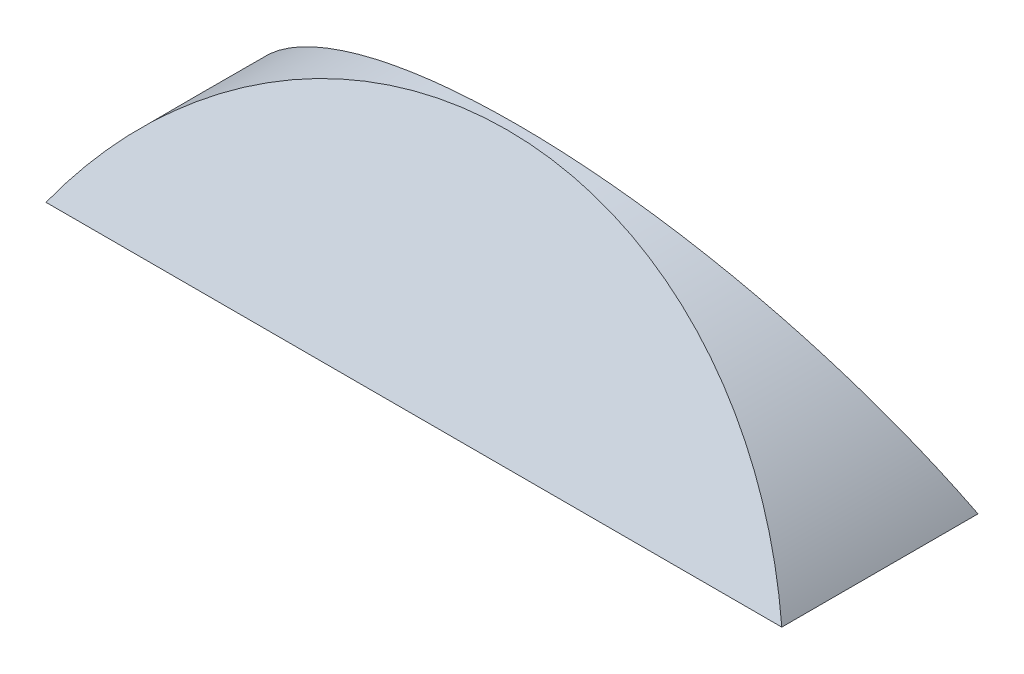
ISO-10303-21;
HEADER;
FILE_DESCRIPTION(('STEP AP214'),'2;1');
FILE_NAME('part.step','',(''),(''),'','','');
FILE_SCHEMA(('AUTOMOTIVE_DESIGN { 1 0 10303 214 1 1 1 1 }'));
ENDSEC;
DATA;
#1=APPLICATION_CONTEXT('core data for automotive mechanical design processes');
#2=APPLICATION_PROTOCOL_DEFINITION('international standard','automotive_design',2000,#1);
#3=PRODUCT_CONTEXT('',#1,'mechanical');
#4=PRODUCT('Part','Part','',(#3));
#5=PRODUCT_RELATED_PRODUCT_CATEGORY('part','',(#4));
#6=PRODUCT_DEFINITION_FORMATION('','',#4);
#7=PRODUCT_DEFINITION_CONTEXT('part definition',#1,'design');
#8=PRODUCT_DEFINITION('design','',#6,#7);
#9=PRODUCT_DEFINITION_SHAPE('','',#8);
#10=(LENGTH_UNIT() NAMED_UNIT(*) SI_UNIT(.MILLI.,.METRE.));
#11=(NAMED_UNIT(*) PLANE_ANGLE_UNIT() SI_UNIT($,.RADIAN.));
#12=(NAMED_UNIT(*) SI_UNIT($,.STERADIAN.) SOLID_ANGLE_UNIT());
#13=UNCERTAINTY_MEASURE_WITH_UNIT(LENGTH_MEASURE(1.E-05),#10,'distance_accuracy_value','');
#14=(GEOMETRIC_REPRESENTATION_CONTEXT(3) GLOBAL_UNCERTAINTY_ASSIGNED_CONTEXT((#13)) GLOBAL_UNIT_ASSIGNED_CONTEXT((#10,
#11,#12)) REPRESENTATION_CONTEXT('',''));
#15=CARTESIAN_POINT('',(0.,0.,0.));
#16=DIRECTION('',(0.,0.,1.));
#17=DIRECTION('',(1.,0.,0.));
#18=AXIS2_PLACEMENT_3D('',#15,#16,#17);
#19=CARTESIAN_POINT('',(0.,-36.252311481466,-36.904730469628));
#20=DIRECTION('',(0.,-0.4226182617407,0.90630778703665));
#21=DIRECTION('',(0.,-0.90630778703665,-0.4226182617407));
#22=AXIS2_PLACEMENT_3D('',#19,#20,#21);
#23=PLANE('',#22);
#24=CARTESIAN_POINT('',(0.,-36.252311481466,-36.904730469628));
#25=DIRECTION('',(0.,-0.4226182617407,0.90630778703665));
#26=DIRECTION('',(0.,-0.90630778703665,-0.4226182617407));
#27=AXIS2_PLACEMENT_3D('',#24,#25,#26);
#28=CIRCLE('',#27,85.);
#29=CARTESIAN_POINT('',(75.,0.,-20.));
#30=VERTEX_POINT('',#29);
#31=CARTESIAN_POINT('',(-75.,0.,-20.));
#32=VERTEX_POINT('',#31);
#33=EDGE_CURVE('E86',#30,#32,#28,.T.);
#34=ORIENTED_EDGE('',*,*,#33,.F.);
#35=DIRECTION('',(1.,0.,0.));
#36=VECTOR('',#35,1.);
#37=CARTESIAN_POINT('',(-75.,0.,-20.));
#38=LINE('',#37,#36);
#39=EDGE_CURVE('E78',#32,#30,#38,.T.);
#40=ORIENTED_EDGE('',*,*,#39,.F.);
#41=EDGE_LOOP('',(#34,#40));
#42=FACE_BOUND('',#41,.T.);
#43=ADVANCED_FACE('F51',(#42),#23,.F.);
#44=CARTESIAN_POINT('',(0.,-36.252311481466,36.904730469628));
#45=DIRECTION('',(0.,-0.4226182617407,-0.90630778703665));
#46=DIRECTION('',(0.,0.90630778703665,-0.4226182617407));
#47=AXIS2_PLACEMENT_3D('',#44,#45,#46);
#48=PLANE('',#47);
#49=CARTESIAN_POINT('',(0.,-36.252311481466,36.904730469628));
#50=DIRECTION('',(0.,0.4226182617407,0.90630778703665));
#51=DIRECTION('',(0.,0.90630778703665,-0.4226182617407));
#52=AXIS2_PLACEMENT_3D('',#49,#50,#51);
#53=CIRCLE('',#52,85.);
#54=CARTESIAN_POINT('',(75.,0.,20.));
#55=VERTEX_POINT('',#54);
#56=CARTESIAN_POINT('',(-75.,0.,20.));
#57=VERTEX_POINT('',#56);
#58=EDGE_CURVE('E62',#55,#57,#53,.T.);
#59=ORIENTED_EDGE('',*,*,#58,.T.);
#60=DIRECTION('',(1.,0.,0.));
#61=VECTOR('',#60,1.);
#62=CARTESIAN_POINT('',(-75.,0.,20.));
#63=LINE('',#62,#61);
#64=EDGE_CURVE('E12',#57,#55,#63,.T.);
#65=ORIENTED_EDGE('',*,*,#64,.T.);
#66=EDGE_LOOP('',(#59,#65));
#67=FACE_BOUND('',#66,.T.);
#68=ADVANCED_FACE('F111',(#67),#48,.F.);
#69=CARTESIAN_POINT('',(0.,0.,0.));
#70=DIRECTION('',(0.,-1.,0.));
#71=DIRECTION('',(0.,0.,-1.));
#72=AXIS2_PLACEMENT_3D('',#69,#70,#71);
#73=PLANE('',#72);
#74=DIRECTION('',(0.,0.,-1.));
#75=VECTOR('',#74,1.);
#76=CARTESIAN_POINT('',(-75.,0.,20.));
#77=LINE('',#76,#75);
#78=EDGE_CURVE('E91',#57,#32,#77,.T.);
#79=ORIENTED_EDGE('',*,*,#78,.T.);
#80=ORIENTED_EDGE('',*,*,#39,.T.);
#81=DIRECTION('',(0.,0.,-1.));
#82=VECTOR('',#81,1.);
#83=CARTESIAN_POINT('',(75.,0.,20.));
#84=LINE('',#83,#82);
#85=EDGE_CURVE('E84',#55,#30,#84,.T.);
#86=ORIENTED_EDGE('',*,*,#85,.F.);
#87=ORIENTED_EDGE('',*,*,#64,.F.);
#88=EDGE_LOOP('',(#79,#80,#86,#87));
#89=FACE_BOUND('',#88,.T.);
#90=ADVANCED_FACE('F94',(#89),#73,.T.);
#91=CARTESIAN_POINT('',(-75.,0.,20.));
#92=CARTESIAN_POINT('',(-75.,0.,-20.));
#93=CARTESIAN_POINT('',(-73.5294117647059,2.49901044219666,18.8346922929944));
#94=CARTESIAN_POINT('',(-73.5294117647059,2.49901044219666,-18.8346922929944));
#95=CARTESIAN_POINT('',(-71.8576386429974,5.00789171171203,17.6647817436177));
#96=CARTESIAN_POINT('',(-71.8576386429974,5.00789171171203,-17.6647817436177));
#97=CARTESIAN_POINT('',(-68.073767530447,9.97882451194646,15.3467977106945));
#98=CARTESIAN_POINT('',(-68.073767530447,9.97882451194646,-15.3467977106945));
#99=CARTESIAN_POINT('',(-65.9614195996733,12.4408186477195,14.1987509908509));
#100=CARTESIAN_POINT('',(-65.9614195996733,12.4408186477195,-14.1987509908509));
#101=CARTESIAN_POINT('',(-61.273507635254,17.2355797843538,11.9629171538143));
#102=CARTESIAN_POINT('',(-61.273507635254,17.2355797843538,-11.9629171538143));
#103=CARTESIAN_POINT('',(-58.6976918746482,19.5681868396791,10.8752046204498));
#104=CARTESIAN_POINT('',(-58.6976918746482,19.5681868396791,-10.8752046204498));
#105=CARTESIAN_POINT('',(-53.0831300431601,24.0090779890694,8.8043830684563));
#106=CARTESIAN_POINT('',(-53.08313004316,24.0090779890694,-8.80438306845629));
#107=CARTESIAN_POINT('',(-50.0441881996465,26.1170885099464,7.82140161910006));
#108=CARTESIAN_POINT('',(-50.0441881996465,26.1170885099464,-7.82140161910006));
#109=CARTESIAN_POINT('',(-43.5337934517297,30.0074762836076,6.00728400704924));
#110=CARTESIAN_POINT('',(-43.5337934517297,30.0074762836076,-6.00728400704925));
#111=CARTESIAN_POINT('',(-40.0622699513512,31.7894858522894,5.17631929826743));
#112=CARTESIAN_POINT('',(-40.0622699513511,31.7894858522894,-5.17631929826743));
#113=CARTESIAN_POINT('',(-32.7515313573936,34.9300790767917,3.7118366265323));
#114=CARTESIAN_POINT('',(-32.7515313573936,34.9300790767917,-3.7118366265323));
#115=CARTESIAN_POINT('',(-28.9124287874893,36.288259091577,3.07850688448484));
#116=CARTESIAN_POINT('',(-28.9124287874893,36.288259091577,-3.07850688448484));
#117=CARTESIAN_POINT('',(-20.9653218237576,38.4987526748946,2.04773679828135));
#118=CARTESIAN_POINT('',(-20.9653218237576,38.4987526748947,-2.04773679828135));
#119=CARTESIAN_POINT('',(-16.8576307678877,39.3507155489836,1.65045998562992));
#120=CARTESIAN_POINT('',(-16.8576307678877,39.3507155489836,-1.65045998562993));
#121=CARTESIAN_POINT('',(-8.4997340549836,40.4933669944875,1.11763286598956));
#122=CARTESIAN_POINT('',(-8.49973405498361,40.4933669944875,-1.11763286598957));
#123=CARTESIAN_POINT('',(-4.25,40.7838504166492,0.982178221668493));
#124=CARTESIAN_POINT('',(-4.25,40.7838504166492,-0.982178221668498));
#125=CARTESIAN_POINT('',(4.25,40.7838504166492,0.982178221668494));
#126=CARTESIAN_POINT('',(4.25,40.7838504166492,-0.9821782216685));
#127=CARTESIAN_POINT('',(8.49973405498358,40.4933669944875,1.11763286598957));
#128=CARTESIAN_POINT('',(8.49973405498359,40.4933669944875,-1.11763286598957));
#129=CARTESIAN_POINT('',(16.8576307678877,39.3507155489836,1.65045998562992));
#130=CARTESIAN_POINT('',(16.8576307678877,39.3507155489836,-1.65045998562993));
#131=CARTESIAN_POINT('',(20.9653218237576,38.4987526748947,2.04773679828135));
#132=CARTESIAN_POINT('',(20.9653218237576,38.4987526748946,-2.04773679828136));
#133=CARTESIAN_POINT('',(28.9124287874893,36.288259091577,3.07850688448484));
#134=CARTESIAN_POINT('',(28.9124287874893,36.288259091577,-3.07850688448484));
#135=CARTESIAN_POINT('',(32.7515313573936,34.9300790767917,3.7118366265323));
#136=CARTESIAN_POINT('',(32.7515313573936,34.9300790767917,-3.71183662653231));
#137=CARTESIAN_POINT('',(40.0622699513511,31.7894858522894,5.17631929826743));
#138=CARTESIAN_POINT('',(40.0622699513511,31.7894858522894,-5.17631929826744));
#139=CARTESIAN_POINT('',(43.5337934517296,30.0074762836076,6.00728400704925));
#140=CARTESIAN_POINT('',(43.5337934517296,30.0074762836076,-6.00728400704925));
#141=CARTESIAN_POINT('',(50.0441881996465,26.1170885099464,7.82140161910006));
#142=CARTESIAN_POINT('',(50.0441881996465,26.1170885099464,-7.82140161910006));
#143=CARTESIAN_POINT('',(53.0831300431601,24.0090779890694,8.8043830684563));
#144=CARTESIAN_POINT('',(53.0831300431601,24.0090779890694,-8.80438306845631));
#145=CARTESIAN_POINT('',(58.6976918746482,19.5681868396791,10.8752046204498));
#146=CARTESIAN_POINT('',(58.6976918746481,19.5681868396791,-10.8752046204498));
#147=CARTESIAN_POINT('',(61.273507635254,17.2355797843538,11.9629171538143));
#148=CARTESIAN_POINT('',(61.273507635254,17.2355797843538,-11.9629171538143));
#149=CARTESIAN_POINT('',(65.9614195996732,12.4408186477194,14.1987509908509));
#150=CARTESIAN_POINT('',(65.9614195996732,12.4408186477194,-14.1987509908509));
#151=CARTESIAN_POINT('',(68.073767530447,9.97882451194645,15.3467977106945));
#152=CARTESIAN_POINT('',(68.073767530447,9.97882451194645,-15.3467977106945));
#153=CARTESIAN_POINT('',(71.8576386429974,5.00789171171202,17.6647817436177));
#154=CARTESIAN_POINT('',(71.8576386429974,5.00789171171202,-17.6647817436177));
#155=CARTESIAN_POINT('',(73.5294117647059,2.49901044219664,18.8346922929944));
#156=CARTESIAN_POINT('',(73.5294117647059,2.49901044219664,-18.8346922929944));
#157=CARTESIAN_POINT('',(75.,0.,20.));
#158=CARTESIAN_POINT('',(75.,0.,-20.));
#159=B_SPLINE_SURFACE_WITH_KNOTS('',3,1,((#91,#92),(#93,#94),(#95,#96),(#97,#98),(#99,#100),
(#101,#102),(#103,#104),(#105,#106),(#107,#108),(#109,#110),(#111,#112),(#113,#114),(#115,#116),
(#117,#118),(#119,#120),(#121,#122),(#123,#124),(#125,#126),(#127,#128),(#129,#130),(#131,#132),
(#133,#134),(#135,#136),(#137,#138),(#139,#140),(#141,#142),(#143,#144),(#145,#146),(#147,#148),
(#149,#150),(#151,#152),(#153,#154),(#155,#156),(#157,#158)),.UNSPECIFIED.,.F.,.F.,.F.,(4,2,2,2,
2,2,2,2,2,2,2,2,2,2,2,2,4),(2,2),(0.,0.0625000000000001,0.125,0.1875,0.25,0.3125,0.375,0.4375,
0.5,0.5625,0.625,0.6875,0.75,0.8125,0.875,0.9375,1.),(0.,1.),.UNSPECIFIED.);
#160=ORIENTED_EDGE('',*,*,#58,.F.);
#161=ORIENTED_EDGE('',*,*,#85,.T.);
#162=ORIENTED_EDGE('',*,*,#33,.T.);
#163=ORIENTED_EDGE('',*,*,#78,.F.);
#164=EDGE_LOOP('',(#160,#161,#162,#163));
#165=FACE_BOUND('',#164,.T.);
#166=ADVANCED_FACE('F85',(#165),#159,.T.);
#167=CLOSED_SHELL('',(#43,#68,#90,#166));
#168=MANIFOLD_SOLID_BREP('B2',#167);
#169=ADVANCED_BREP_SHAPE_REPRESENTATION('',(#18,#168),#14);
#170=SHAPE_DEFINITION_REPRESENTATION(#9,#169);
ENDSEC;
END-ISO-10303-21;
